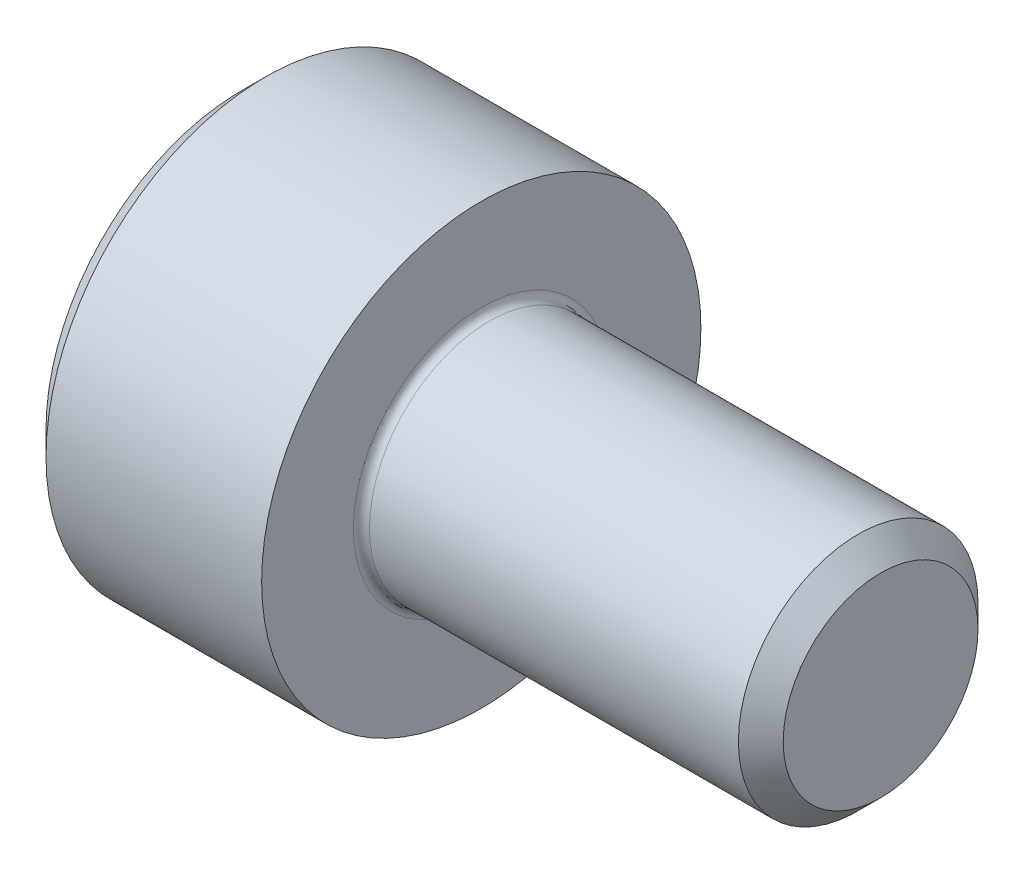
ISO-10303-21;
HEADER;
FILE_DESCRIPTION(('STEP AP214'),'2;1');
FILE_NAME('part.step','',(''),(''),'','','');
FILE_SCHEMA(('AUTOMOTIVE_DESIGN { 1 0 10303 214 1 1 1 1 }'));
ENDSEC;
DATA;
#1=APPLICATION_CONTEXT('core data for automotive mechanical design processes');
#2=APPLICATION_PROTOCOL_DEFINITION('international standard','automotive_design',2000,#1);
#3=PRODUCT_CONTEXT('',#1,'mechanical');
#4=PRODUCT('Part','Part','',(#3));
#5=PRODUCT_RELATED_PRODUCT_CATEGORY('part','',(#4));
#6=PRODUCT_DEFINITION_FORMATION('','',#4);
#7=PRODUCT_DEFINITION_CONTEXT('part definition',#1,'design');
#8=PRODUCT_DEFINITION('design','',#6,#7);
#9=PRODUCT_DEFINITION_SHAPE('','',#8);
#10=(LENGTH_UNIT() NAMED_UNIT(*) SI_UNIT(.MILLI.,.METRE.));
#11=(NAMED_UNIT(*) PLANE_ANGLE_UNIT() SI_UNIT($,.RADIAN.));
#12=(NAMED_UNIT(*) SI_UNIT($,.STERADIAN.) SOLID_ANGLE_UNIT());
#13=UNCERTAINTY_MEASURE_WITH_UNIT(LENGTH_MEASURE(1.E-05),#10,'distance_accuracy_value','');
#14=(GEOMETRIC_REPRESENTATION_CONTEXT(3) GLOBAL_UNCERTAINTY_ASSIGNED_CONTEXT((#13)) GLOBAL_UNIT_ASSIGNED_CONTEXT((#10,
#11,#12)) REPRESENTATION_CONTEXT('',''));
#15=CARTESIAN_POINT('',(0.,0.,0.));
#16=DIRECTION('',(0.,0.,1.));
#17=DIRECTION('',(1.,0.,0.));
#18=AXIS2_PLACEMENT_3D('',#15,#16,#17);
#19=CARTESIAN_POINT('',(0.,0.,0.));
#20=DIRECTION('',(-1.,0.,0.));
#21=DIRECTION('',(0.,0.,1.));
#22=AXIS2_PLACEMENT_3D('',#19,#20,#21);
#23=PLANE('',#22);
#24=DIRECTION('',(0.,-0.5,0.86602540378444));
#25=VECTOR('',#24,1.);
#26=CARTESIAN_POINT('',(0.,1.47801668912544,0.));
#27=LINE('',#26,#25);
#28=CARTESIAN_POINT('',(0.,1.47801668912544,0.));
#29=VERTEX_POINT('',#28);
#30=CARTESIAN_POINT('',(0.,0.73900834456272,1.28));
#31=VERTEX_POINT('',#30);
#32=EDGE_CURVE('E378',#29,#31,#27,.T.);
#33=ORIENTED_EDGE('',*,*,#32,.T.);
#34=DIRECTION('',(0.,1.,0.));
#35=VECTOR('',#34,1.);
#36=CARTESIAN_POINT('',(0.,-0.739008344562722,1.28));
#37=LINE('',#36,#35);
#38=CARTESIAN_POINT('',(0.,-0.739008344562722,1.28));
#39=VERTEX_POINT('',#38);
#40=EDGE_CURVE('E113',#39,#31,#37,.T.);
#41=ORIENTED_EDGE('',*,*,#40,.F.);
#42=DIRECTION('',(0.,-0.5,-0.866025403784438));
#43=VECTOR('',#42,1.);
#44=CARTESIAN_POINT('',(0.,-0.739008344562722,1.28));
#45=LINE('',#44,#43);
#46=CARTESIAN_POINT('',(0.,-1.47801668912544,0.));
#47=VERTEX_POINT('',#46);
#48=EDGE_CURVE('E381',#39,#47,#45,.T.);
#49=ORIENTED_EDGE('',*,*,#48,.T.);
#50=DIRECTION('',(0.,0.5,-0.86602540378444));
#51=VECTOR('',#50,1.);
#52=CARTESIAN_POINT('',(0.,-1.47801668912544,0.));
#53=LINE('',#52,#51);
#54=CARTESIAN_POINT('',(0.,-0.739008344562726,-1.28));
#55=VERTEX_POINT('',#54);
#56=EDGE_CURVE('E384',#47,#55,#53,.T.);
#57=ORIENTED_EDGE('',*,*,#56,.T.);
#58=DIRECTION('',(0.,-1.,0.));
#59=VECTOR('',#58,1.);
#60=CARTESIAN_POINT('',(0.,0.739008344562716,-1.28));
#61=LINE('',#60,#59);
#62=CARTESIAN_POINT('',(0.,0.739008344562716,-1.28));
#63=VERTEX_POINT('',#62);
#64=EDGE_CURVE('E387',#63,#55,#61,.T.);
#65=ORIENTED_EDGE('',*,*,#64,.F.);
#66=DIRECTION('',(0.,-0.5,-0.866025403784438));
#67=VECTOR('',#66,1.);
#68=CARTESIAN_POINT('',(0.,1.47801668912544,0.));
#69=LINE('',#68,#67);
#70=EDGE_CURVE('E108',#29,#63,#69,.T.);
#71=ORIENTED_EDGE('',*,*,#70,.F.);
#72=EDGE_LOOP('',(#33,#41,#49,#57,#65,#71));
#73=FACE_BOUND('',#72,.T.);
#74=CARTESIAN_POINT('',(0.,0.,0.));
#75=DIRECTION('',(-1.,0.,0.));
#76=DIRECTION('',(0.,0.,1.));
#77=AXIS2_PLACEMENT_3D('',#74,#75,#76);
#78=CIRCLE('',#77,2.45);
#79=CARTESIAN_POINT('',(0.,0.,2.45));
#80=VERTEX_POINT('',#79);
#81=EDGE_CURVE('E124',#80,#80,#78,.T.);
#82=ORIENTED_EDGE('',*,*,#81,.T.);
#83=EDGE_LOOP('',(#82));
#84=FACE_BOUND('',#83,.T.);
#85=ADVANCED_FACE('F17',(#73,#84),#23,.T.);
#86=CARTESIAN_POINT('',(8.,1.2195,0.));
#87=DIRECTION('',(1.,0.,0.));
#88=DIRECTION('',(0.,0.,-1.));
#89=AXIS2_PLACEMENT_3D('',#86,#87,#88);
#90=PLANE('',#89);
#91=CARTESIAN_POINT('',(8.,0.,0.));
#92=DIRECTION('',(-1.,0.,0.));
#93=DIRECTION('',(0.,0.,1.));
#94=AXIS2_PLACEMENT_3D('',#91,#92,#93);
#95=CIRCLE('',#94,1.2195);
#96=CARTESIAN_POINT('',(8.,0.,1.2195));
#97=VERTEX_POINT('',#96);
#98=EDGE_CURVE('E137',#97,#97,#95,.T.);
#99=ORIENTED_EDGE('',*,*,#98,.F.);
#100=EDGE_LOOP('',(#99));
#101=FACE_BOUND('',#100,.T.);
#102=ADVANCED_FACE('F159',(#101),#90,.T.);
#103=CARTESIAN_POINT('',(8.,0.,0.));
#104=DIRECTION('',(-1.,0.,0.));
#105=DIRECTION('',(0.,0.,1.));
#106=AXIS2_PLACEMENT_3D('',#103,#104,#105);
#107=CONICAL_SURFACE('',#106,1.2195,0.785398163397469);
#108=CARTESIAN_POINT('',(7.7195,0.,0.));
#109=DIRECTION('',(-1.,0.,0.));
#110=DIRECTION('',(0.,0.,1.));
#111=AXIS2_PLACEMENT_3D('',#108,#109,#110);
#112=CIRCLE('',#111,1.5);
#113=CARTESIAN_POINT('',(7.7195,0.,1.5));
#114=VERTEX_POINT('',#113);
#115=EDGE_CURVE('E134',#114,#114,#112,.T.);
#116=ORIENTED_EDGE('',*,*,#115,.F.);
#117=EDGE_LOOP('',(#116));
#118=FACE_BOUND('',#117,.T.);
#119=ORIENTED_EDGE('',*,*,#98,.T.);
#120=EDGE_LOOP('',(#119));
#121=FACE_BOUND('',#120,.T.);
#122=ADVANCED_FACE('F165',(#118,#121),#107,.T.);
#123=CARTESIAN_POINT('',(-31.75,0.,0.));
#124=DIRECTION('',(-1.,0.,0.));
#125=DIRECTION('',(0.,0.,1.));
#126=AXIS2_PLACEMENT_3D('',#123,#124,#125);
#127=CYLINDRICAL_SURFACE('',#126,1.5);
#128=CARTESIAN_POINT('',(3.1,0.,0.));
#129=DIRECTION('',(1.,0.,0.));
#130=DIRECTION('',(0.,0.,-1.));
#131=AXIS2_PLACEMENT_3D('',#128,#129,#130);
#132=CIRCLE('',#131,1.5);
#133=CARTESIAN_POINT('',(3.1,0.,-1.5));
#134=VERTEX_POINT('',#133);
#135=EDGE_CURVE('E11',#134,#134,#132,.T.);
#136=ORIENTED_EDGE('',*,*,#135,.T.);
#137=EDGE_LOOP('',(#136));
#138=FACE_BOUND('',#137,.T.);
#139=ORIENTED_EDGE('',*,*,#115,.T.);
#140=EDGE_LOOP('',(#139));
#141=FACE_BOUND('',#140,.T.);
#142=ADVANCED_FACE('F176',(#138,#141),#127,.T.);
#143=CARTESIAN_POINT('',(3.,2.75,0.));
#144=DIRECTION('',(1.,0.,0.));
#145=DIRECTION('',(0.,0.,-1.));
#146=AXIS2_PLACEMENT_3D('',#143,#144,#145);
#147=PLANE('',#146);
#148=CARTESIAN_POINT('',(3.,0.,0.));
#149=DIRECTION('',(1.,0.,0.));
#150=DIRECTION('',(0.,0.,-1.));
#151=AXIS2_PLACEMENT_3D('',#148,#149,#150);
#152=CIRCLE('',#151,1.6);
#153=CARTESIAN_POINT('',(3.,0.,-1.6));
#154=VERTEX_POINT('',#153);
#155=EDGE_CURVE('E25',#154,#154,#152,.F.);
#156=ORIENTED_EDGE('',*,*,#155,.T.);
#157=EDGE_LOOP('',(#156));
#158=FACE_BOUND('',#157,.T.);
#159=CARTESIAN_POINT('',(3.,0.,0.));
#160=DIRECTION('',(-1.,0.,0.));
#161=DIRECTION('',(0.,0.,1.));
#162=AXIS2_PLACEMENT_3D('',#159,#160,#161);
#163=CIRCLE('',#162,2.75);
#164=CARTESIAN_POINT('',(3.,0.,2.75));
#165=VERTEX_POINT('',#164);
#166=EDGE_CURVE('E131',#165,#165,#163,.T.);
#167=ORIENTED_EDGE('',*,*,#166,.F.);
#168=EDGE_LOOP('',(#167));
#169=FACE_BOUND('',#168,.T.);
#170=ADVANCED_FACE('F142',(#158,#169),#147,.T.);
#171=CARTESIAN_POINT('',(-31.75,0.,0.));
#172=DIRECTION('',(-1.,0.,0.));
#173=DIRECTION('',(0.,0.,1.));
#174=AXIS2_PLACEMENT_3D('',#171,#172,#173);
#175=CYLINDRICAL_SURFACE('',#174,2.75);
#176=ORIENTED_EDGE('',*,*,#166,.T.);
#177=EDGE_LOOP('',(#176));
#178=FACE_BOUND('',#177,.T.);
#179=CARTESIAN_POINT('',(0.3,0.,0.));
#180=DIRECTION('',(-1.,0.,0.));
#181=DIRECTION('',(0.,0.,1.));
#182=AXIS2_PLACEMENT_3D('',#179,#180,#181);
#183=CIRCLE('',#182,2.75);
#184=CARTESIAN_POINT('',(0.3,0.,2.75));
#185=VERTEX_POINT('',#184);
#186=EDGE_CURVE('E128',#185,#185,#183,.T.);
#187=ORIENTED_EDGE('',*,*,#186,.F.);
#188=EDGE_LOOP('',(#187));
#189=FACE_BOUND('',#188,.T.);
#190=ADVANCED_FACE('F154',(#178,#189),#175,.T.);
#191=CARTESIAN_POINT('',(0.,0.,0.));
#192=DIRECTION('',(1.,0.,0.));
#193=DIRECTION('',(0.,0.,-1.));
#194=AXIS2_PLACEMENT_3D('',#191,#192,#193);
#195=CONICAL_SURFACE('',#194,2.45,0.785398163397448);
#196=ORIENTED_EDGE('',*,*,#186,.T.);
#197=EDGE_LOOP('',(#196));
#198=FACE_BOUND('',#197,.T.);
#199=ORIENTED_EDGE('',*,*,#81,.F.);
#200=EDGE_LOOP('',(#199));
#201=FACE_BOUND('',#200,.T.);
#202=ADVANCED_FACE('F146',(#198,#201),#195,.T.);
#203=CARTESIAN_POINT('',(3.1,0.,0.));
#204=DIRECTION('',(1.,0.,0.));
#205=DIRECTION('',(0.,0.,-1.));
#206=AXIS2_PLACEMENT_3D('',#203,#204,#205);
#207=TOROIDAL_SURFACE('',#206,1.6,0.1);
#208=ORIENTED_EDGE('',*,*,#135,.F.);
#209=EDGE_LOOP('',(#208));
#210=FACE_BOUND('',#209,.T.);
#211=ORIENTED_EDGE('',*,*,#155,.F.);
#212=EDGE_LOOP('',(#211));
#213=FACE_BOUND('',#212,.T.);
#214=ADVANCED_FACE('F19',(#210,#213),#207,.F.);
#215=CARTESIAN_POINT('',(1.3,1.47801668912544,0.));
#216=DIRECTION('',(0.,-0.86602540378444,-0.5));
#217=DIRECTION('',(0.,0.5,-0.86602540378444));
#218=AXIS2_PLACEMENT_3D('',#215,#216,#217);
#219=PLANE('',#218);
#220=ORIENTED_EDGE('',*,*,#32,.F.);
#221=DIRECTION('',(-1.,0.,0.));
#222=VECTOR('',#221,1.);
#223=CARTESIAN_POINT('',(1.3,1.47801668912544,0.));
#224=LINE('',#223,#222);
#225=CARTESIAN_POINT('',(1.3,1.47801668912544,0.));
#226=VERTEX_POINT('',#225);
#227=EDGE_CURVE('E377',#226,#29,#224,.T.);
#228=ORIENTED_EDGE('',*,*,#227,.F.);
#229=DIRECTION('',(0.,-0.5,0.86602540378444));
#230=VECTOR('',#229,1.);
#231=CARTESIAN_POINT('',(1.3,1.47801668912544,0.));
#232=LINE('',#231,#230);
#233=CARTESIAN_POINT('',(1.3,1.10851251684408,0.64));
#234=VERTEX_POINT('',#233);
#235=EDGE_CURVE('E100',#226,#234,#232,.T.);
#236=ORIENTED_EDGE('',*,*,#235,.T.);
#237=CARTESIAN_POINT('',(1.3,0.73900834456272,1.28));
#238=VERTEX_POINT('',#237);
#239=EDGE_CURVE('E91',#234,#238,#232,.T.);
#240=ORIENTED_EDGE('',*,*,#239,.T.);
#241=DIRECTION('',(-1.,0.,0.));
#242=VECTOR('',#241,1.);
#243=CARTESIAN_POINT('',(1.3,0.73900834456272,1.28));
#244=LINE('',#243,#242);
#245=EDGE_CURVE('E105',#238,#31,#244,.T.);
#246=ORIENTED_EDGE('',*,*,#245,.T.);
#247=EDGE_LOOP('',(#220,#228,#236,#240,#246));
#248=FACE_BOUND('',#247,.T.);
#249=ADVANCED_FACE('F104',(#248),#219,.T.);
#250=CARTESIAN_POINT('',(1.3,-0.739008344562722,1.28));
#251=DIRECTION('',(0.,0.,1.));
#252=DIRECTION('',(0.,-1.,0.));
#253=AXIS2_PLACEMENT_3D('',#250,#251,#252);
#254=PLANE('',#253);
#255=ORIENTED_EDGE('',*,*,#40,.T.);
#256=ORIENTED_EDGE('',*,*,#245,.F.);
#257=DIRECTION('',(0.,1.,0.));
#258=VECTOR('',#257,1.);
#259=CARTESIAN_POINT('',(1.3,-0.739008344562722,1.28));
#260=LINE('',#259,#258);
#261=CARTESIAN_POINT('',(1.3,0.,1.28));
#262=VERTEX_POINT('',#261);
#263=EDGE_CURVE('E88',#262,#238,#260,.T.);
#264=ORIENTED_EDGE('',*,*,#263,.F.);
#265=CARTESIAN_POINT('',(1.3,-0.739008344562722,1.28));
#266=VERTEX_POINT('',#265);
#267=EDGE_CURVE('E99',#266,#262,#260,.T.);
#268=ORIENTED_EDGE('',*,*,#267,.F.);
#269=DIRECTION('',(-1.,0.,0.));
#270=VECTOR('',#269,1.);
#271=CARTESIAN_POINT('',(1.3,-0.739008344562722,1.28));
#272=LINE('',#271,#270);
#273=EDGE_CURVE('E115',#266,#39,#272,.T.);
#274=ORIENTED_EDGE('',*,*,#273,.T.);
#275=EDGE_LOOP('',(#255,#256,#264,#268,#274));
#276=FACE_BOUND('',#275,.T.);
#277=ADVANCED_FACE('F110',(#276),#254,.F.);
#278=CARTESIAN_POINT('',(1.3,-0.739008344562722,1.28));
#279=DIRECTION('',(0.,0.866025403784438,-0.5));
#280=DIRECTION('',(0.,0.5,0.866025403784438));
#281=AXIS2_PLACEMENT_3D('',#278,#279,#280);
#282=PLANE('',#281);
#283=ORIENTED_EDGE('',*,*,#48,.F.);
#284=ORIENTED_EDGE('',*,*,#273,.F.);
#285=DIRECTION('',(0.,-0.5,-0.866025403784438));
#286=VECTOR('',#285,1.);
#287=CARTESIAN_POINT('',(1.3,-0.739008344562722,1.28));
#288=LINE('',#287,#286);
#289=CARTESIAN_POINT('',(1.3,-1.10851251684408,0.64));
#290=VERTEX_POINT('',#289);
#291=EDGE_CURVE('E358',#266,#290,#288,.T.);
#292=ORIENTED_EDGE('',*,*,#291,.T.);
#293=CARTESIAN_POINT('',(1.3,-1.47801668912544,0.));
#294=VERTEX_POINT('',#293);
#295=EDGE_CURVE('E360',#290,#294,#288,.T.);
#296=ORIENTED_EDGE('',*,*,#295,.T.);
#297=DIRECTION('',(-1.,0.,0.));
#298=VECTOR('',#297,1.);
#299=CARTESIAN_POINT('',(1.3,-1.47801668912544,0.));
#300=LINE('',#299,#298);
#301=EDGE_CURVE('E120',#294,#47,#300,.T.);
#302=ORIENTED_EDGE('',*,*,#301,.T.);
#303=EDGE_LOOP('',(#283,#284,#292,#296,#302));
#304=FACE_BOUND('',#303,.T.);
#305=ADVANCED_FACE('F236',(#304),#282,.T.);
#306=CARTESIAN_POINT('',(1.3,-1.47801668912544,0.));
#307=DIRECTION('',(0.,0.86602540378444,0.5));
#308=DIRECTION('',(0.,-0.5,0.86602540378444));
#309=AXIS2_PLACEMENT_3D('',#306,#307,#308);
#310=PLANE('',#309);
#311=ORIENTED_EDGE('',*,*,#56,.F.);
#312=ORIENTED_EDGE('',*,*,#301,.F.);
#313=DIRECTION('',(0.,0.5,-0.86602540378444));
#314=VECTOR('',#313,1.);
#315=CARTESIAN_POINT('',(1.3,-1.47801668912544,0.));
#316=LINE('',#315,#314);
#317=CARTESIAN_POINT('',(1.3,-1.10851251684408,-0.64));
#318=VERTEX_POINT('',#317);
#319=EDGE_CURVE('E363',#294,#318,#316,.T.);
#320=ORIENTED_EDGE('',*,*,#319,.T.);
#321=CARTESIAN_POINT('',(1.3,-0.739008344562726,-1.28));
#322=VERTEX_POINT('',#321);
#323=EDGE_CURVE('E367',#318,#322,#316,.T.);
#324=ORIENTED_EDGE('',*,*,#323,.T.);
#325=DIRECTION('',(-1.,0.,0.));
#326=VECTOR('',#325,1.);
#327=CARTESIAN_POINT('',(1.3,-0.739008344562726,-1.28));
#328=LINE('',#327,#326);
#329=EDGE_CURVE('E396',#322,#55,#328,.T.);
#330=ORIENTED_EDGE('',*,*,#329,.T.);
#331=EDGE_LOOP('',(#311,#312,#320,#324,#330));
#332=FACE_BOUND('',#331,.T.);
#333=ADVANCED_FACE('F246',(#332),#310,.T.);
#334=CARTESIAN_POINT('',(1.3,0.739008344562716,-1.28));
#335=DIRECTION('',(0.,0.,-1.));
#336=DIRECTION('',(0.,1.,0.));
#337=AXIS2_PLACEMENT_3D('',#334,#335,#336);
#338=PLANE('',#337);
#339=ORIENTED_EDGE('',*,*,#64,.T.);
#340=ORIENTED_EDGE('',*,*,#329,.F.);
#341=DIRECTION('',(0.,-1.,0.));
#342=VECTOR('',#341,1.);
#343=CARTESIAN_POINT('',(1.3,0.739008344562716,-1.28));
#344=LINE('',#343,#342);
#345=CARTESIAN_POINT('',(1.3,0.,-1.28));
#346=VERTEX_POINT('',#345);
#347=EDGE_CURVE('E371',#346,#322,#344,.T.);
#348=ORIENTED_EDGE('',*,*,#347,.F.);
#349=CARTESIAN_POINT('',(1.3,0.739008344562716,-1.28));
#350=VERTEX_POINT('',#349);
#351=EDGE_CURVE('E32',#350,#346,#344,.T.);
#352=ORIENTED_EDGE('',*,*,#351,.F.);
#353=DIRECTION('',(-1.,0.,0.));
#354=VECTOR('',#353,1.);
#355=CARTESIAN_POINT('',(1.3,0.739008344562716,-1.28));
#356=LINE('',#355,#354);
#357=EDGE_CURVE('E393',#350,#63,#356,.T.);
#358=ORIENTED_EDGE('',*,*,#357,.T.);
#359=EDGE_LOOP('',(#339,#340,#348,#352,#358));
#360=FACE_BOUND('',#359,.T.);
#361=ADVANCED_FACE('F256',(#360),#338,.F.);
#362=CARTESIAN_POINT('',(1.3,1.47801668912544,0.));
#363=DIRECTION('',(0.,0.866025403784438,-0.5));
#364=DIRECTION('',(0.,0.5,0.866025403784438));
#365=AXIS2_PLACEMENT_3D('',#362,#363,#364);
#366=PLANE('',#365);
#367=ORIENTED_EDGE('',*,*,#70,.T.);
#368=ORIENTED_EDGE('',*,*,#357,.F.);
#369=DIRECTION('',(0.,-0.5,-0.866025403784438));
#370=VECTOR('',#369,1.);
#371=CARTESIAN_POINT('',(1.3,1.47801668912544,0.));
#372=LINE('',#371,#370);
#373=CARTESIAN_POINT('',(1.3,1.10851251684408,-0.64));
#374=VERTEX_POINT('',#373);
#375=EDGE_CURVE('E373',#374,#350,#372,.T.);
#376=ORIENTED_EDGE('',*,*,#375,.F.);
#377=EDGE_CURVE('E374',#226,#374,#372,.T.);
#378=ORIENTED_EDGE('',*,*,#377,.F.);
#379=ORIENTED_EDGE('',*,*,#227,.T.);
#380=EDGE_LOOP('',(#367,#368,#376,#378,#379));
#381=FACE_BOUND('',#380,.T.);
#382=ADVANCED_FACE('F266',(#381),#366,.F.);
#383=CARTESIAN_POINT('',(1.3,2.21702503368815,-1.28));
#384=DIRECTION('',(1.,0.,0.));
#385=DIRECTION('',(0.,0.,-1.));
#386=AXIS2_PLACEMENT_3D('',#383,#384,#385);
#387=PLANE('',#386);
#388=ORIENTED_EDGE('',*,*,#347,.T.);
#389=ORIENTED_EDGE('',*,*,#323,.F.);
#390=CARTESIAN_POINT('',(1.3,0.,0.));
#391=DIRECTION('',(-1.,0.,0.));
#392=DIRECTION('',(0.,0.,1.));
#393=AXIS2_PLACEMENT_3D('',#390,#391,#392);
#394=CIRCLE('',#393,1.28);
#395=EDGE_CURVE('E403',#346,#318,#394,.T.);
#396=ORIENTED_EDGE('',*,*,#395,.F.);
#397=EDGE_LOOP('',(#388,#389,#396));
#398=FACE_BOUND('',#397,.T.);
#399=ADVANCED_FACE('F276',(#398),#387,.F.);
#400=ORIENTED_EDGE('',*,*,#319,.F.);
#401=ORIENTED_EDGE('',*,*,#295,.F.);
#402=EDGE_CURVE('E118',#318,#290,#394,.T.);
#403=ORIENTED_EDGE('',*,*,#402,.F.);
#404=EDGE_LOOP('',(#400,#401,#403));
#405=FACE_BOUND('',#404,.T.);
#406=ADVANCED_FACE('F286',(#405),#387,.F.);
#407=ORIENTED_EDGE('',*,*,#291,.F.);
#408=ORIENTED_EDGE('',*,*,#267,.T.);
#409=EDGE_CURVE('E114',#290,#262,#394,.T.);
#410=ORIENTED_EDGE('',*,*,#409,.F.);
#411=EDGE_LOOP('',(#407,#408,#410));
#412=FACE_BOUND('',#411,.T.);
#413=ADVANCED_FACE('F297',(#412),#387,.F.);
#414=ORIENTED_EDGE('',*,*,#263,.T.);
#415=ORIENTED_EDGE('',*,*,#239,.F.);
#416=EDGE_CURVE('E94',#262,#234,#394,.T.);
#417=ORIENTED_EDGE('',*,*,#416,.F.);
#418=EDGE_LOOP('',(#414,#415,#417));
#419=FACE_BOUND('',#418,.T.);
#420=ADVANCED_FACE('F90',(#419),#387,.F.);
#421=ORIENTED_EDGE('',*,*,#235,.F.);
#422=ORIENTED_EDGE('',*,*,#377,.T.);
#423=EDGE_CURVE('E125',#234,#374,#394,.T.);
#424=ORIENTED_EDGE('',*,*,#423,.F.);
#425=EDGE_LOOP('',(#421,#422,#424));
#426=FACE_BOUND('',#425,.T.);
#427=ADVANCED_FACE('F314',(#426),#387,.F.);
#428=ORIENTED_EDGE('',*,*,#375,.T.);
#429=ORIENTED_EDGE('',*,*,#351,.T.);
#430=EDGE_CURVE('E402',#374,#346,#394,.T.);
#431=ORIENTED_EDGE('',*,*,#430,.F.);
#432=EDGE_LOOP('',(#428,#429,#431));
#433=FACE_BOUND('',#432,.T.);
#434=ADVANCED_FACE('F289',(#433),#387,.F.);
#435=CARTESIAN_POINT('',(1.3,0.,0.));
#436=DIRECTION('',(-1.,0.,0.));
#437=DIRECTION('',(0.,0.,1.));
#438=AXIS2_PLACEMENT_3D('',#435,#436,#437);
#439=CONICAL_SURFACE('',#438,1.28,1.0471975511966);
#440=CARTESIAN_POINT('',(2.03900834456273,0.,0.));
#441=VERTEX_POINT('',#440);
#442=VERTEX_LOOP('',#441);
#443=FACE_BOUND('',#442,.T.);
#444=ORIENTED_EDGE('',*,*,#416,.T.);
#445=ORIENTED_EDGE('',*,*,#423,.T.);
#446=ORIENTED_EDGE('',*,*,#430,.T.);
#447=ORIENTED_EDGE('',*,*,#395,.T.);
#448=ORIENTED_EDGE('',*,*,#402,.T.);
#449=ORIENTED_EDGE('',*,*,#409,.T.);
#450=EDGE_LOOP('',(#444,#445,#446,#447,#448,#449));
#451=FACE_BOUND('',#450,.T.);
#452=ADVANCED_FACE('F169',(#443,#451),#439,.F.);
#453=CLOSED_SHELL('',(#85,#102,#122,#142,#170,#190,#202,#214,#249,#277,#305,#333,#361,#382,#399,
#406,#413,#420,#427,#434,#452));
#454=MANIFOLD_SOLID_BREP('B1',#453);
#455=ADVANCED_BREP_SHAPE_REPRESENTATION('',(#18,#454),#14);
#456=SHAPE_DEFINITION_REPRESENTATION(#9,#455);
ENDSEC;
END-ISO-10303-21;
